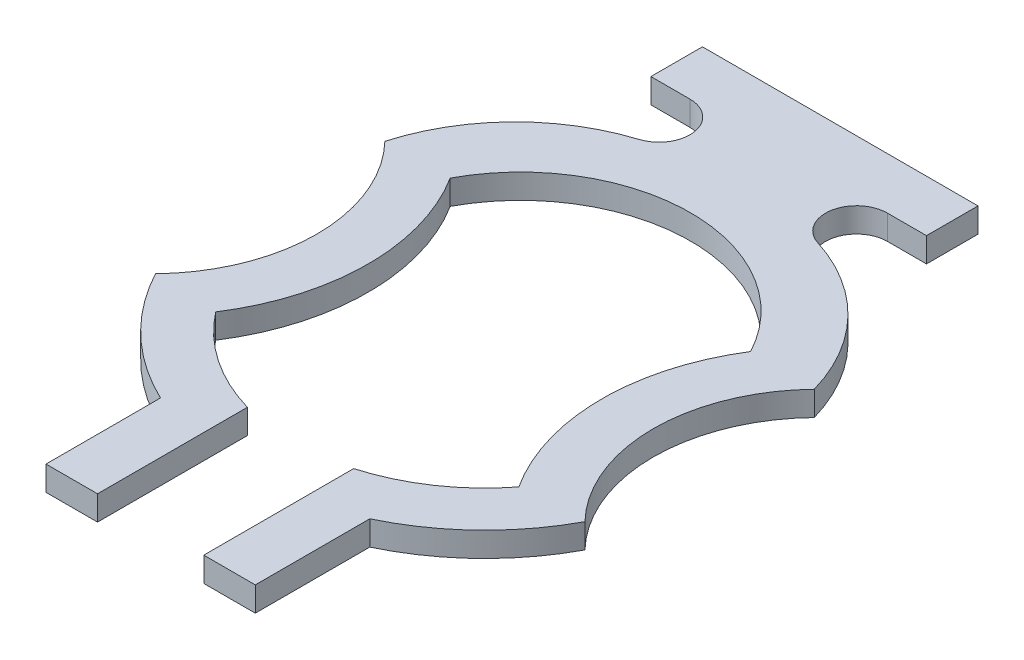
ISO-10303-21;
HEADER;
FILE_DESCRIPTION(('STEP AP214'),'2;1');
FILE_NAME('part.step','',(''),(''),'','','');
FILE_SCHEMA(('AUTOMOTIVE_DESIGN { 1 0 10303 214 1 1 1 1 }'));
ENDSEC;
DATA;
#1=APPLICATION_CONTEXT('core data for automotive mechanical design processes');
#2=APPLICATION_PROTOCOL_DEFINITION('international standard','automotive_design',2000,#1);
#3=PRODUCT_CONTEXT('',#1,'mechanical');
#4=PRODUCT('Part','Part','',(#3));
#5=PRODUCT_RELATED_PRODUCT_CATEGORY('part','',(#4));
#6=PRODUCT_DEFINITION_FORMATION('','',#4);
#7=PRODUCT_DEFINITION_CONTEXT('part definition',#1,'design');
#8=PRODUCT_DEFINITION('design','',#6,#7);
#9=PRODUCT_DEFINITION_SHAPE('','',#8);
#10=(LENGTH_UNIT() NAMED_UNIT(*) SI_UNIT(.MILLI.,.METRE.));
#11=(NAMED_UNIT(*) PLANE_ANGLE_UNIT() SI_UNIT($,.RADIAN.));
#12=(NAMED_UNIT(*) SI_UNIT($,.STERADIAN.) SOLID_ANGLE_UNIT());
#13=UNCERTAINTY_MEASURE_WITH_UNIT(LENGTH_MEASURE(1.E-05),#10,'distance_accuracy_value','');
#14=(GEOMETRIC_REPRESENTATION_CONTEXT(3) GLOBAL_UNCERTAINTY_ASSIGNED_CONTEXT((#13)) GLOBAL_UNIT_ASSIGNED_CONTEXT((#10,
#11,#12)) REPRESENTATION_CONTEXT('',''));
#15=CARTESIAN_POINT('',(0.,0.,0.));
#16=DIRECTION('',(0.,0.,1.));
#17=DIRECTION('',(1.,0.,0.));
#18=AXIS2_PLACEMENT_3D('',#15,#16,#17);
#19=CARTESIAN_POINT('',(0.,0.075,-0.1085));
#20=DIRECTION('',(0.,-1.,0.));
#21=DIRECTION('',(0.,0.,-1.));
#22=AXIS2_PLACEMENT_3D('',#19,#20,#21);
#23=CYLINDRICAL_SURFACE('',#22,0.520300000000001);
#24=CARTESIAN_POINT('',(0.,0.,-0.1085));
#25=DIRECTION('',(0.,-1.,0.));
#26=DIRECTION('',(0.,0.,1.));
#27=AXIS2_PLACEMENT_3D('',#24,#25,#26);
#28=CIRCLE('',#27,0.520300000000001);
#29=CARTESIAN_POINT('',(-0.459187912512323,0.,-0.353160072350572));
#30=VERTEX_POINT('',#29);
#31=CARTESIAN_POINT('',(0.459187912512322,0.,-0.353160072350571));
#32=VERTEX_POINT('',#31);
#33=EDGE_CURVE('E227',#30,#32,#28,.T.);
#34=ORIENTED_EDGE('',*,*,#33,.T.);
#35=DIRECTION('',(0.,-1.,0.));
#36=VECTOR('',#35,1.);
#37=CARTESIAN_POINT('',(0.459187912512322,0.075,-0.353160072350571));
#38=LINE('',#37,#36);
#39=CARTESIAN_POINT('',(0.459187912512322,0.075,-0.353160072350571));
#40=VERTEX_POINT('',#39);
#41=EDGE_CURVE('E11',#40,#32,#38,.T.);
#42=ORIENTED_EDGE('',*,*,#41,.F.);
#43=CARTESIAN_POINT('',(0.,0.075,-0.1085));
#44=DIRECTION('',(0.,-1.,0.));
#45=DIRECTION('',(0.,0.,1.));
#46=AXIS2_PLACEMENT_3D('',#43,#44,#45);
#47=CIRCLE('',#46,0.520300000000001);
#48=CARTESIAN_POINT('',(-0.459187912512323,0.075,-0.353160072350572));
#49=VERTEX_POINT('',#48);
#50=EDGE_CURVE('E273',#49,#40,#47,.T.);
#51=ORIENTED_EDGE('',*,*,#50,.F.);
#52=DIRECTION('',(0.,-1.,0.));
#53=VECTOR('',#52,1.);
#54=CARTESIAN_POINT('',(-0.459187912512323,0.075,-0.353160072350572));
#55=LINE('',#54,#53);
#56=EDGE_CURVE('E223',#49,#30,#55,.T.);
#57=ORIENTED_EDGE('',*,*,#56,.T.);
#58=EDGE_LOOP('',(#34,#42,#51,#57));
#59=FACE_BOUND('',#58,.T.);
#60=ADVANCED_FACE('F35',(#59),#23,.F.);
#61=CARTESIAN_POINT('',(1.01900000000682,0.075,0.));
#62=DIRECTION('',(0.,-1.,0.));
#63=DIRECTION('',(0.,0.,-1.));
#64=AXIS2_PLACEMENT_3D('',#61,#62,#63);
#65=CYLINDRICAL_SURFACE('',#64,0.66190000000575);
#66=CARTESIAN_POINT('',(1.01900000000682,0.,0.));
#67=DIRECTION('',(0.,1.,0.));
#68=DIRECTION('',(0.,0.,1.));
#69=AXIS2_PLACEMENT_3D('',#66,#67,#68);
#70=CIRCLE('',#69,0.66190000000575);
#71=CARTESIAN_POINT('',(0.463312875368008,0.,0.359615669177845));
#72=VERTEX_POINT('',#71);
#73=EDGE_CURVE('E230',#32,#72,#70,.T.);
#74=ORIENTED_EDGE('',*,*,#73,.T.);
#75=DIRECTION('',(0.,-1.,0.));
#76=VECTOR('',#75,1.);
#77=CARTESIAN_POINT('',(0.463312875368008,0.075,0.359615669177845));
#78=LINE('',#77,#76);
#79=CARTESIAN_POINT('',(0.463312875368008,0.075,0.359615669177845));
#80=VERTEX_POINT('',#79);
#81=EDGE_CURVE('E43',#80,#72,#78,.T.);
#82=ORIENTED_EDGE('',*,*,#81,.F.);
#83=CARTESIAN_POINT('',(1.01900000000682,0.075,0.));
#84=DIRECTION('',(0.,1.,0.));
#85=DIRECTION('',(0.,0.,1.));
#86=AXIS2_PLACEMENT_3D('',#83,#84,#85);
#87=CIRCLE('',#86,0.66190000000575);
#88=EDGE_CURVE('E142',#40,#80,#87,.T.);
#89=ORIENTED_EDGE('',*,*,#88,.F.);
#90=ORIENTED_EDGE('',*,*,#41,.T.);
#91=EDGE_LOOP('',(#74,#82,#89,#90));
#92=FACE_BOUND('',#91,.T.);
#93=ADVANCED_FACE('F411',(#92),#65,.T.);
#94=CARTESIAN_POINT('',(0.,0.075,0.));
#95=DIRECTION('',(0.,-1.,0.));
#96=DIRECTION('',(0.,0.,-1.));
#97=AXIS2_PLACEMENT_3D('',#94,#95,#96);
#98=CYLINDRICAL_SURFACE('',#97,0.5865);
#99=CARTESIAN_POINT('',(0.,0.,0.));
#100=DIRECTION('',(0.,-1.,0.));
#101=DIRECTION('',(0.,0.,1.));
#102=AXIS2_PLACEMENT_3D('',#99,#100,#101);
#103=CIRCLE('',#102,0.5865);
#104=CARTESIAN_POINT('',(0.1624,0.,0.563567644564519));
#105=VERTEX_POINT('',#104);
#106=EDGE_CURVE('E232',#72,#105,#103,.T.);
#107=ORIENTED_EDGE('',*,*,#106,.T.);
#108=DIRECTION('',(0.,-1.,0.));
#109=VECTOR('',#108,1.);
#110=CARTESIAN_POINT('',(0.1624,0.075,0.563567644564519));
#111=LINE('',#110,#109);
#112=CARTESIAN_POINT('',(0.1624,0.075,0.563567644564519));
#113=VERTEX_POINT('',#112);
#114=EDGE_CURVE('E328',#113,#105,#111,.T.);
#115=ORIENTED_EDGE('',*,*,#114,.F.);
#116=CARTESIAN_POINT('',(0.,0.075,0.));
#117=DIRECTION('',(0.,-1.,0.));
#118=DIRECTION('',(0.,0.,1.));
#119=AXIS2_PLACEMENT_3D('',#116,#117,#118);
#120=CIRCLE('',#119,0.5865);
#121=EDGE_CURVE('E336',#80,#113,#120,.T.);
#122=ORIENTED_EDGE('',*,*,#121,.F.);
#123=ORIENTED_EDGE('',*,*,#81,.T.);
#124=EDGE_LOOP('',(#107,#115,#122,#123));
#125=FACE_BOUND('',#124,.T.);
#126=ADVANCED_FACE('F334',(#125),#98,.F.);
#127=CARTESIAN_POINT('',(0.1624,0.075,0.563567644564519));
#128=DIRECTION('',(1.,0.,7.01860133029449E-12));
#129=DIRECTION('',(7.01860133029449E-12,0.,-1.));
#130=AXIS2_PLACEMENT_3D('',#127,#128,#129);
#131=PLANE('',#130);
#132=DIRECTION('',(-7.0186013302945E-12,0.,1.));
#133=VECTOR('',#132,1.);
#134=CARTESIAN_POINT('',(0.1624,0.,0.563567644564519));
#135=LINE('',#134,#133);
#136=CARTESIAN_POINT('',(0.162399999996784,0.,1.02179999999476));
#137=VERTEX_POINT('',#136);
#138=EDGE_CURVE('E234',#105,#137,#135,.T.);
#139=ORIENTED_EDGE('',*,*,#138,.T.);
#140=DIRECTION('',(0.,-1.,0.));
#141=VECTOR('',#140,1.);
#142=CARTESIAN_POINT('',(0.162399999996784,0.075,1.02179999999476));
#143=LINE('',#142,#141);
#144=CARTESIAN_POINT('',(0.162399999996784,0.075,1.02179999999476));
#145=VERTEX_POINT('',#144);
#146=EDGE_CURVE('E325',#145,#137,#143,.T.);
#147=ORIENTED_EDGE('',*,*,#146,.F.);
#148=DIRECTION('',(-7.0186013302945E-12,0.,1.));
#149=VECTOR('',#148,1.);
#150=CARTESIAN_POINT('',(0.1624,0.075,0.563567644564519));
#151=LINE('',#150,#149);
#152=EDGE_CURVE('E354',#113,#145,#151,.T.);
#153=ORIENTED_EDGE('',*,*,#152,.F.);
#154=ORIENTED_EDGE('',*,*,#114,.T.);
#155=EDGE_LOOP('',(#139,#147,#153,#154));
#156=FACE_BOUND('',#155,.T.);
#157=ADVANCED_FACE('F345',(#156),#131,.F.);
#158=CARTESIAN_POINT('',(0.162399999996784,0.075,1.02179999999476));
#159=DIRECTION('',(0.,0.,-1.));
#160=DIRECTION('',(-1.,0.,0.));
#161=AXIS2_PLACEMENT_3D('',#158,#159,#160);
#162=PLANE('',#161);
#163=DIRECTION('',(1.,0.,0.));
#164=VECTOR('',#163,1.);
#165=CARTESIAN_POINT('',(0.162399999996784,0.,1.02179999999476));
#166=LINE('',#165,#164);
#167=CARTESIAN_POINT('',(0.319899999996911,0.,1.02179999999476));
#168=VERTEX_POINT('',#167);
#169=EDGE_CURVE('E236',#137,#168,#166,.T.);
#170=ORIENTED_EDGE('',*,*,#169,.T.);
#171=DIRECTION('',(0.,-1.,0.));
#172=VECTOR('',#171,1.);
#173=CARTESIAN_POINT('',(0.319899999996911,0.075,1.02179999999476));
#174=LINE('',#173,#172);
#175=CARTESIAN_POINT('',(0.319899999996911,0.075,1.02179999999476));
#176=VERTEX_POINT('',#175);
#177=EDGE_CURVE('E322',#176,#168,#174,.T.);
#178=ORIENTED_EDGE('',*,*,#177,.F.);
#179=DIRECTION('',(1.,0.,0.));
#180=VECTOR('',#179,1.);
#181=CARTESIAN_POINT('',(0.162399999996784,0.075,1.02179999999476));
#182=LINE('',#181,#180);
#183=EDGE_CURVE('E351',#145,#176,#182,.T.);
#184=ORIENTED_EDGE('',*,*,#183,.F.);
#185=ORIENTED_EDGE('',*,*,#146,.T.);
#186=EDGE_LOOP('',(#170,#178,#184,#185));
#187=FACE_BOUND('',#186,.T.);
#188=ADVANCED_FACE('F349',(#187),#162,.F.);
#189=CARTESIAN_POINT('',(0.319899999996911,0.075,1.02179999999476));
#190=DIRECTION('',(-1.,0.,-8.8258806434341E-12));
#191=DIRECTION('',(-8.8258806434341E-12,0.,1.));
#192=AXIS2_PLACEMENT_3D('',#189,#190,#191);
#193=PLANE('',#192);
#194=DIRECTION('',(8.8258806434341E-12,0.,-1.));
#195=VECTOR('',#194,1.);
#196=CARTESIAN_POINT('',(0.319899999996911,0.,1.02179999999476));
#197=LINE('',#196,#195);
#198=CARTESIAN_POINT('',(0.3199,0.,0.671824977207606));
#199=VERTEX_POINT('',#198);
#200=EDGE_CURVE('E238',#168,#199,#197,.T.);
#201=ORIENTED_EDGE('',*,*,#200,.T.);
#202=DIRECTION('',(0.,-1.,0.));
#203=VECTOR('',#202,1.);
#204=CARTESIAN_POINT('',(0.3199,0.075,0.671824977207606));
#205=LINE('',#204,#203);
#206=CARTESIAN_POINT('',(0.3199,0.075,0.671824977207606));
#207=VERTEX_POINT('',#206);
#208=EDGE_CURVE('E319',#207,#199,#205,.T.);
#209=ORIENTED_EDGE('',*,*,#208,.F.);
#210=DIRECTION('',(8.8258806434341E-12,0.,-1.));
#211=VECTOR('',#210,1.);
#212=CARTESIAN_POINT('',(0.319899999996911,0.075,1.02179999999476));
#213=LINE('',#212,#211);
#214=EDGE_CURVE('E353',#176,#207,#213,.T.);
#215=ORIENTED_EDGE('',*,*,#214,.F.);
#216=ORIENTED_EDGE('',*,*,#177,.T.);
#217=EDGE_LOOP('',(#201,#209,#215,#216));
#218=FACE_BOUND('',#217,.T.);
#219=ADVANCED_FACE('F424',(#218),#193,.F.);
#220=CARTESIAN_POINT('',(0.,0.075,0.));
#221=DIRECTION('',(0.,-1.,0.));
#222=DIRECTION('',(0.,0.,-1.));
#223=AXIS2_PLACEMENT_3D('',#220,#221,#222);
#224=CYLINDRICAL_SURFACE('',#223,0.7441);
#225=CARTESIAN_POINT('',(0.,0.,0.));
#226=DIRECTION('',(0.,1.,0.));
#227=DIRECTION('',(0.,0.,1.));
#228=AXIS2_PLACEMENT_3D('',#225,#226,#227);
#229=CIRCLE('',#228,0.7441);
#230=CARTESIAN_POINT('',(0.656342713446317,0.,0.350569611499692));
#231=VERTEX_POINT('',#230);
#232=EDGE_CURVE('E240',#199,#231,#229,.T.);
#233=ORIENTED_EDGE('',*,*,#232,.T.);
#234=DIRECTION('',(0.,-1.,0.));
#235=VECTOR('',#234,1.);
#236=CARTESIAN_POINT('',(0.656342713446317,0.075,0.350569611499692));
#237=LINE('',#236,#235);
#238=CARTESIAN_POINT('',(0.656342713446317,0.075,0.350569611499692));
#239=VERTEX_POINT('',#238);
#240=EDGE_CURVE('E316',#239,#231,#237,.T.);
#241=ORIENTED_EDGE('',*,*,#240,.F.);
#242=CARTESIAN_POINT('',(0.,0.075,0.));
#243=DIRECTION('',(0.,1.,0.));
#244=DIRECTION('',(0.,0.,1.));
#245=AXIS2_PLACEMENT_3D('',#242,#243,#244);
#246=CIRCLE('',#245,0.7441);
#247=EDGE_CURVE('E356',#207,#239,#246,.T.);
#248=ORIENTED_EDGE('',*,*,#247,.F.);
#249=ORIENTED_EDGE('',*,*,#208,.T.);
#250=EDGE_LOOP('',(#233,#241,#248,#249));
#251=FACE_BOUND('',#250,.T.);
#252=ADVANCED_FACE('F427',(#251),#224,.T.);
#253=CARTESIAN_POINT('',(1.01900000000682,0.075,0.));
#254=DIRECTION('',(0.,-1.,0.));
#255=DIRECTION('',(0.,0.,-1.));
#256=AXIS2_PLACEMENT_3D('',#253,#254,#255);
#257=CYLINDRICAL_SURFACE('',#256,0.504400000002453);
#258=CARTESIAN_POINT('',(1.01900000000682,0.,0.));
#259=DIRECTION('',(0.,-1.,0.));
#260=DIRECTION('',(0.,0.,1.));
#261=AXIS2_PLACEMENT_3D('',#258,#259,#260);
#262=CIRCLE('',#261,0.504400000002453);
#263=CARTESIAN_POINT('',(0.656331281055102,0.,-0.350557784529729));
#264=VERTEX_POINT('',#263);
#265=EDGE_CURVE('E242',#231,#264,#262,.T.);
#266=ORIENTED_EDGE('',*,*,#265,.T.);
#267=DIRECTION('',(0.,-1.,0.));
#268=VECTOR('',#267,1.);
#269=CARTESIAN_POINT('',(0.656331281055102,0.075,-0.350557784529729));
#270=LINE('',#269,#268);
#271=CARTESIAN_POINT('',(0.656331281055102,0.075,-0.350557784529729));
#272=VERTEX_POINT('',#271);
#273=EDGE_CURVE('E313',#272,#264,#270,.T.);
#274=ORIENTED_EDGE('',*,*,#273,.F.);
#275=CARTESIAN_POINT('',(1.01900000000682,0.075,0.));
#276=DIRECTION('',(0.,-1.,0.));
#277=DIRECTION('',(0.,0.,1.));
#278=AXIS2_PLACEMENT_3D('',#275,#276,#277);
#279=CIRCLE('',#278,0.504400000002453);
#280=EDGE_CURVE('E362',#239,#272,#279,.T.);
#281=ORIENTED_EDGE('',*,*,#280,.F.);
#282=ORIENTED_EDGE('',*,*,#240,.T.);
#283=EDGE_LOOP('',(#266,#274,#281,#282));
#284=FACE_BOUND('',#283,.T.);
#285=ADVANCED_FACE('F431',(#284),#257,.F.);
#286=CARTESIAN_POINT('',(0.099500000002291,0.075,-0.191511456562074));
#287=DIRECTION('',(0.,-1.,0.));
#288=DIRECTION('',(0.,0.,-1.));
#289=AXIS2_PLACEMENT_3D('',#286,#287,#288);
#290=CYLINDRICAL_SURFACE('',#289,0.579099999999059);
#291=CARTESIAN_POINT('',(0.099500000002291,0.,-0.191511456562074));
#292=DIRECTION('',(0.,1.,0.));
#293=DIRECTION('',(0.,0.,1.));
#294=AXIS2_PLACEMENT_3D('',#291,#292,#293);
#295=CIRCLE('',#294,0.579099999999059);
#296=CARTESIAN_POINT('',(0.27344932199932,0.,-0.743868626674488));
#297=VERTEX_POINT('',#296);
#298=EDGE_CURVE('E244',#264,#297,#295,.T.);
#299=ORIENTED_EDGE('',*,*,#298,.T.);
#300=DIRECTION('',(0.,-1.,0.));
#301=VECTOR('',#300,1.);
#302=CARTESIAN_POINT('',(0.27344932199932,0.075,-0.743868626674488));
#303=LINE('',#302,#301);
#304=CARTESIAN_POINT('',(0.27344932199932,0.075,-0.743868626674488));
#305=VERTEX_POINT('',#304);
#306=EDGE_CURVE('E310',#305,#297,#303,.T.);
#307=ORIENTED_EDGE('',*,*,#306,.F.);
#308=CARTESIAN_POINT('',(0.099500000002291,0.075,-0.191511456562074));
#309=DIRECTION('',(0.,1.,0.));
#310=DIRECTION('',(0.,0.,1.));
#311=AXIS2_PLACEMENT_3D('',#308,#309,#310);
#312=CIRCLE('',#311,0.579099999999059);
#313=EDGE_CURVE('E364',#272,#305,#312,.T.);
#314=ORIENTED_EDGE('',*,*,#313,.F.);
#315=ORIENTED_EDGE('',*,*,#273,.T.);
#316=EDGE_LOOP('',(#299,#307,#314,#315));
#317=FACE_BOUND('',#316,.T.);
#318=ADVANCED_FACE('F435',(#317),#290,.T.);
#319=CARTESIAN_POINT('',(0.301865149768224,0.075,-0.8341));
#320=DIRECTION('',(0.,-1.,0.));
#321=DIRECTION('',(0.,0.,-1.));
#322=AXIS2_PLACEMENT_3D('',#319,#320,#321);
#323=CYLINDRICAL_SURFACE('',#322,0.0946000000000001);
#324=CARTESIAN_POINT('',(0.301865149768224,0.,-0.8341));
#325=DIRECTION('',(0.,-1.,0.));
#326=DIRECTION('',(0.,0.,1.));
#327=AXIS2_PLACEMENT_3D('',#324,#325,#326);
#328=CIRCLE('',#327,0.0946000000000001);
#329=CARTESIAN_POINT('',(0.301865149768224,0.,-0.9287));
#330=VERTEX_POINT('',#329);
#331=EDGE_CURVE('E246',#297,#330,#328,.T.);
#332=ORIENTED_EDGE('',*,*,#331,.T.);
#333=DIRECTION('',(0.,-1.,0.));
#334=VECTOR('',#333,1.);
#335=CARTESIAN_POINT('',(0.301865149768224,0.075,-0.9287));
#336=LINE('',#335,#334);
#337=CARTESIAN_POINT('',(0.301865149768224,0.075,-0.9287));
#338=VERTEX_POINT('',#337);
#339=EDGE_CURVE('E307',#338,#330,#336,.T.);
#340=ORIENTED_EDGE('',*,*,#339,.F.);
#341=CARTESIAN_POINT('',(0.301865149768224,0.075,-0.8341));
#342=DIRECTION('',(0.,-1.,0.));
#343=DIRECTION('',(0.,0.,1.));
#344=AXIS2_PLACEMENT_3D('',#341,#342,#343);
#345=CIRCLE('',#344,0.0946000000000001);
#346=EDGE_CURVE('E366',#305,#338,#345,.T.);
#347=ORIENTED_EDGE('',*,*,#346,.F.);
#348=ORIENTED_EDGE('',*,*,#306,.T.);
#349=EDGE_LOOP('',(#332,#340,#347,#348));
#350=FACE_BOUND('',#349,.T.);
#351=ADVANCED_FACE('F439',(#350),#323,.F.);
#352=CARTESIAN_POINT('',(0.301865149768224,0.075,-0.9287));
#353=DIRECTION('',(-1.21135339235406E-11,0.,-1.));
#354=DIRECTION('',(-1.,0.,1.21135339235406E-11));
#355=AXIS2_PLACEMENT_3D('',#352,#353,#354);
#356=PLANE('',#355);
#357=DIRECTION('',(1.,0.,-1.21135339235406E-11));
#358=VECTOR('',#357,1.);
#359=CARTESIAN_POINT('',(0.301865149768224,0.,-0.9287));
#360=LINE('',#359,#358);
#361=CARTESIAN_POINT('',(0.421200000002614,0.,-0.928700000001445));
#362=VERTEX_POINT('',#361);
#363=EDGE_CURVE('E248',#330,#362,#360,.T.);
#364=ORIENTED_EDGE('',*,*,#363,.T.);
#365=DIRECTION('',(0.,-1.,0.));
#366=VECTOR('',#365,1.);
#367=CARTESIAN_POINT('',(0.421200000002614,0.075,-0.928700000001445));
#368=LINE('',#367,#366);
#369=CARTESIAN_POINT('',(0.421200000002614,0.075,-0.928700000001445));
#370=VERTEX_POINT('',#369);
#371=EDGE_CURVE('E304',#370,#362,#368,.T.);
#372=ORIENTED_EDGE('',*,*,#371,.F.);
#373=DIRECTION('',(1.,0.,-1.21135339235406E-11));
#374=VECTOR('',#373,1.);
#375=CARTESIAN_POINT('',(0.301865149768224,0.075,-0.9287));
#376=LINE('',#375,#374);
#377=EDGE_CURVE('E368',#338,#370,#376,.T.);
#378=ORIENTED_EDGE('',*,*,#377,.F.);
#379=ORIENTED_EDGE('',*,*,#339,.T.);
#380=EDGE_LOOP('',(#364,#372,#378,#379));
#381=FACE_BOUND('',#380,.T.);
#382=ADVANCED_FACE('F443',(#381),#356,.F.);
#383=CARTESIAN_POINT('',(0.421200000002614,0.075,-1.08620000000157));
#384=DIRECTION('',(-1.,0.,0.));
#385=DIRECTION('',(0.,0.,1.));
#386=AXIS2_PLACEMENT_3D('',#383,#384,#385);
#387=PLANE('',#386);
#388=DIRECTION('',(0.,0.,-1.));
#389=VECTOR('',#388,1.);
#390=CARTESIAN_POINT('',(0.421200000002614,0.,-1.08620000000157));
#391=LINE('',#390,#389);
#392=CARTESIAN_POINT('',(0.421200000002614,0.,-1.08620000000157));
#393=VERTEX_POINT('',#392);
#394=EDGE_CURVE('E250',#362,#393,#391,.T.);
#395=ORIENTED_EDGE('',*,*,#394,.T.);
#396=DIRECTION('',(0.,-1.,0.));
#397=VECTOR('',#396,1.);
#398=CARTESIAN_POINT('',(0.421200000002614,0.075,-1.08620000000157));
#399=LINE('',#398,#397);
#400=CARTESIAN_POINT('',(0.421200000002614,0.075,-1.08620000000157));
#401=VERTEX_POINT('',#400);
#402=EDGE_CURVE('E301',#401,#393,#399,.T.);
#403=ORIENTED_EDGE('',*,*,#402,.F.);
#404=DIRECTION('',(0.,0.,-1.));
#405=VECTOR('',#404,1.);
#406=CARTESIAN_POINT('',(0.421200000002614,0.075,-1.08620000000157));
#407=LINE('',#406,#405);
#408=EDGE_CURVE('E370',#370,#401,#407,.T.);
#409=ORIENTED_EDGE('',*,*,#408,.F.);
#410=ORIENTED_EDGE('',*,*,#371,.T.);
#411=EDGE_LOOP('',(#395,#403,#409,#410));
#412=FACE_BOUND('',#411,.T.);
#413=ADVANCED_FACE('F447',(#412),#387,.F.);
#414=CARTESIAN_POINT('',(-0.421200000002622,0.075,-1.08620000000157));
#415=DIRECTION('',(0.,0.,1.));
#416=DIRECTION('',(1.,0.,0.));
#417=AXIS2_PLACEMENT_3D('',#414,#415,#416);
#418=PLANE('',#417);
#419=DIRECTION('',(-1.,0.,0.));
#420=VECTOR('',#419,1.);
#421=CARTESIAN_POINT('',(-0.421200000002622,0.,-1.08620000000157));
#422=LINE('',#421,#420);
#423=CARTESIAN_POINT('',(-0.421200000002622,0.,-1.08620000000157));
#424=VERTEX_POINT('',#423);
#425=EDGE_CURVE('E252',#393,#424,#422,.T.);
#426=ORIENTED_EDGE('',*,*,#425,.T.);
#427=DIRECTION('',(0.,-1.,0.));
#428=VECTOR('',#427,1.);
#429=CARTESIAN_POINT('',(-0.421200000002622,0.075,-1.08620000000157));
#430=LINE('',#429,#428);
#431=CARTESIAN_POINT('',(-0.421200000002622,0.075,-1.08620000000157));
#432=VERTEX_POINT('',#431);
#433=EDGE_CURVE('E298',#432,#424,#430,.T.);
#434=ORIENTED_EDGE('',*,*,#433,.F.);
#435=DIRECTION('',(-1.,0.,0.));
#436=VECTOR('',#435,1.);
#437=CARTESIAN_POINT('',(-0.421200000002622,0.075,-1.08620000000157));
#438=LINE('',#437,#436);
#439=EDGE_CURVE('E372',#401,#432,#438,.T.);
#440=ORIENTED_EDGE('',*,*,#439,.F.);
#441=ORIENTED_EDGE('',*,*,#402,.T.);
#442=EDGE_LOOP('',(#426,#434,#440,#441));
#443=FACE_BOUND('',#442,.T.);
#444=ADVANCED_FACE('F451',(#443),#418,.F.);
#445=CARTESIAN_POINT('',(-0.421200000002622,0.075,-1.08620000000157));
#446=DIRECTION('',(1.,0.,0.));
#447=DIRECTION('',(0.,0.,-1.));
#448=AXIS2_PLACEMENT_3D('',#445,#446,#447);
#449=PLANE('',#448);
#450=DIRECTION('',(0.,0.,1.));
#451=VECTOR('',#450,1.);
#452=CARTESIAN_POINT('',(-0.421200000002622,0.,-1.08620000000157));
#453=LINE('',#452,#451);
#454=CARTESIAN_POINT('',(-0.421200000002621,0.,-0.928700000001445));
#455=VERTEX_POINT('',#454);
#456=EDGE_CURVE('E254',#424,#455,#453,.T.);
#457=ORIENTED_EDGE('',*,*,#456,.T.);
#458=DIRECTION('',(0.,-1.,0.));
#459=VECTOR('',#458,1.);
#460=CARTESIAN_POINT('',(-0.421200000002621,0.075,-0.928700000001445));
#461=LINE('',#460,#459);
#462=CARTESIAN_POINT('',(-0.421200000002621,0.075,-0.928700000001445));
#463=VERTEX_POINT('',#462);
#464=EDGE_CURVE('E295',#463,#455,#461,.T.);
#465=ORIENTED_EDGE('',*,*,#464,.F.);
#466=DIRECTION('',(0.,0.,1.));
#467=VECTOR('',#466,1.);
#468=CARTESIAN_POINT('',(-0.421200000002622,0.075,-1.08620000000157));
#469=LINE('',#468,#467);
#470=EDGE_CURVE('E374',#432,#463,#469,.T.);
#471=ORIENTED_EDGE('',*,*,#470,.F.);
#472=ORIENTED_EDGE('',*,*,#433,.T.);
#473=EDGE_LOOP('',(#457,#465,#471,#472));
#474=FACE_BOUND('',#473,.T.);
#475=ADVANCED_FACE('F455',(#474),#449,.F.);
#476=CARTESIAN_POINT('',(-0.301865149768231,0.075,-0.9287));
#477=DIRECTION('',(1.21135339235406E-11,0.,-1.));
#478=DIRECTION('',(-1.,0.,-1.21135339235406E-11));
#479=AXIS2_PLACEMENT_3D('',#476,#477,#478);
#480=PLANE('',#479);
#481=DIRECTION('',(1.,0.,1.21135339235406E-11));
#482=VECTOR('',#481,1.);
#483=CARTESIAN_POINT('',(-0.301865149768231,0.,-0.9287));
#484=LINE('',#483,#482);
#485=CARTESIAN_POINT('',(-0.301865149768231,0.,-0.9287));
#486=VERTEX_POINT('',#485);
#487=EDGE_CURVE('E256',#455,#486,#484,.T.);
#488=ORIENTED_EDGE('',*,*,#487,.T.);
#489=DIRECTION('',(0.,-1.,0.));
#490=VECTOR('',#489,1.);
#491=CARTESIAN_POINT('',(-0.301865149768231,0.075,-0.9287));
#492=LINE('',#491,#490);
#493=CARTESIAN_POINT('',(-0.301865149768231,0.075,-0.9287));
#494=VERTEX_POINT('',#493);
#495=EDGE_CURVE('E292',#494,#486,#492,.T.);
#496=ORIENTED_EDGE('',*,*,#495,.F.);
#497=DIRECTION('',(1.,0.,1.21135339235406E-11));
#498=VECTOR('',#497,1.);
#499=CARTESIAN_POINT('',(-0.301865149768231,0.075,-0.9287));
#500=LINE('',#499,#498);
#501=EDGE_CURVE('E376',#463,#494,#500,.T.);
#502=ORIENTED_EDGE('',*,*,#501,.F.);
#503=ORIENTED_EDGE('',*,*,#464,.T.);
#504=EDGE_LOOP('',(#488,#496,#502,#503));
#505=FACE_BOUND('',#504,.T.);
#506=ADVANCED_FACE('F459',(#505),#480,.F.);
#507=CARTESIAN_POINT('',(-0.30186514976823,0.075,-0.8341));
#508=DIRECTION('',(0.,-1.,0.));
#509=DIRECTION('',(0.,0.,-1.));
#510=AXIS2_PLACEMENT_3D('',#507,#508,#509);
#511=CYLINDRICAL_SURFACE('',#510,0.0946000000000002);
#512=CARTESIAN_POINT('',(-0.30186514976823,0.,-0.8341));
#513=DIRECTION('',(0.,-1.,0.));
#514=DIRECTION('',(0.,0.,-1.));
#515=AXIS2_PLACEMENT_3D('',#512,#513,#514);
#516=CIRCLE('',#515,0.0946000000000002);
#517=CARTESIAN_POINT('',(-0.273449321999608,0.,-0.743868626675385));
#518=VERTEX_POINT('',#517);
#519=EDGE_CURVE('E258',#486,#518,#516,.T.);
#520=ORIENTED_EDGE('',*,*,#519,.T.);
#521=DIRECTION('',(0.,-1.,0.));
#522=VECTOR('',#521,1.);
#523=CARTESIAN_POINT('',(-0.273449321999608,0.075,-0.743868626675385));
#524=LINE('',#523,#522);
#525=CARTESIAN_POINT('',(-0.273449321999608,0.075,-0.743868626675385));
#526=VERTEX_POINT('',#525);
#527=EDGE_CURVE('E289',#526,#518,#524,.T.);
#528=ORIENTED_EDGE('',*,*,#527,.F.);
#529=CARTESIAN_POINT('',(-0.30186514976823,0.075,-0.8341));
#530=DIRECTION('',(0.,-1.,0.));
#531=DIRECTION('',(0.,0.,-1.));
#532=AXIS2_PLACEMENT_3D('',#529,#530,#531);
#533=CIRCLE('',#532,0.0946000000000002);
#534=EDGE_CURVE('E378',#494,#526,#533,.T.);
#535=ORIENTED_EDGE('',*,*,#534,.F.);
#536=ORIENTED_EDGE('',*,*,#495,.T.);
#537=EDGE_LOOP('',(#520,#528,#535,#536));
#538=FACE_BOUND('',#537,.T.);
#539=ADVANCED_FACE('F463',(#538),#511,.F.);
#540=CARTESIAN_POINT('',(-0.0995000000022924,0.075,-0.191511456562074));
#541=DIRECTION('',(0.,-1.,0.));
#542=DIRECTION('',(0.,0.,-1.));
#543=AXIS2_PLACEMENT_3D('',#540,#541,#542);
#544=CYLINDRICAL_SURFACE('',#543,0.57909999999906);
#545=CARTESIAN_POINT('',(-0.0995000000022924,0.,-0.191511456562074));
#546=DIRECTION('',(0.,1.,0.));
#547=DIRECTION('',(0.,0.,-1.));
#548=AXIS2_PLACEMENT_3D('',#545,#546,#547);
#549=CIRCLE('',#548,0.57909999999906);
#550=CARTESIAN_POINT('',(-0.656331281054245,0.,-0.350557784531694));
#551=VERTEX_POINT('',#550);
#552=EDGE_CURVE('E260',#518,#551,#549,.T.);
#553=ORIENTED_EDGE('',*,*,#552,.T.);
#554=DIRECTION('',(0.,-1.,0.));
#555=VECTOR('',#554,1.);
#556=CARTESIAN_POINT('',(-0.656331281054245,0.075,-0.350557784531694));
#557=LINE('',#556,#555);
#558=CARTESIAN_POINT('',(-0.656331281054245,0.075,-0.350557784531694));
#559=VERTEX_POINT('',#558);
#560=EDGE_CURVE('E286',#559,#551,#557,.T.);
#561=ORIENTED_EDGE('',*,*,#560,.F.);
#562=CARTESIAN_POINT('',(-0.0995000000022924,0.075,-0.191511456562074));
#563=DIRECTION('',(0.,1.,0.));
#564=DIRECTION('',(0.,0.,-1.));
#565=AXIS2_PLACEMENT_3D('',#562,#563,#564);
#566=CIRCLE('',#565,0.57909999999906);
#567=EDGE_CURVE('E380',#526,#559,#566,.T.);
#568=ORIENTED_EDGE('',*,*,#567,.F.);
#569=ORIENTED_EDGE('',*,*,#527,.T.);
#570=EDGE_LOOP('',(#553,#561,#568,#569));
#571=FACE_BOUND('',#570,.T.);
#572=ADVANCED_FACE('F467',(#571),#544,.T.);
#573=CARTESIAN_POINT('',(-1.01900000000682,0.075,0.));
#574=DIRECTION('',(0.,-1.,0.));
#575=DIRECTION('',(0.,0.,-1.));
#576=AXIS2_PLACEMENT_3D('',#573,#574,#575);
#577=CYLINDRICAL_SURFACE('',#576,0.504400000002453);
#578=CARTESIAN_POINT('',(-1.01900000000682,0.,0.));
#579=DIRECTION('',(0.,-1.,0.));
#580=DIRECTION('',(0.,0.,-1.));
#581=AXIS2_PLACEMENT_3D('',#578,#579,#580);
#582=CIRCLE('',#581,0.504400000002453);
#583=CARTESIAN_POINT('',(-0.656342713444551,0.,0.350569611501397));
#584=VERTEX_POINT('',#583);
#585=EDGE_CURVE('E262',#551,#584,#582,.T.);
#586=ORIENTED_EDGE('',*,*,#585,.T.);
#587=DIRECTION('',(0.,-1.,0.));
#588=VECTOR('',#587,1.);
#589=CARTESIAN_POINT('',(-0.656342713444551,0.075,0.350569611501397));
#590=LINE('',#589,#588);
#591=CARTESIAN_POINT('',(-0.656342713444551,0.075,0.350569611501397));
#592=VERTEX_POINT('',#591);
#593=EDGE_CURVE('E283',#592,#584,#590,.T.);
#594=ORIENTED_EDGE('',*,*,#593,.F.);
#595=CARTESIAN_POINT('',(-1.01900000000682,0.075,0.));
#596=DIRECTION('',(0.,-1.,0.));
#597=DIRECTION('',(0.,0.,-1.));
#598=AXIS2_PLACEMENT_3D('',#595,#596,#597);
#599=CIRCLE('',#598,0.504400000002453);
#600=EDGE_CURVE('E382',#559,#592,#599,.T.);
#601=ORIENTED_EDGE('',*,*,#600,.F.);
#602=ORIENTED_EDGE('',*,*,#560,.T.);
#603=EDGE_LOOP('',(#586,#594,#601,#602));
#604=FACE_BOUND('',#603,.T.);
#605=ADVANCED_FACE('F471',(#604),#577,.F.);
#606=CARTESIAN_POINT('',(0.,0.075,0.));
#607=DIRECTION('',(0.,-1.,0.));
#608=DIRECTION('',(0.,0.,-1.));
#609=AXIS2_PLACEMENT_3D('',#606,#607,#608);
#610=CYLINDRICAL_SURFACE('',#609,0.744099999999998);
#611=CARTESIAN_POINT('',(0.,0.,0.));
#612=DIRECTION('',(0.,1.,0.));
#613=DIRECTION('',(0.,0.,-1.));
#614=AXIS2_PLACEMENT_3D('',#611,#612,#613);
#615=CIRCLE('',#614,0.744099999999998);
#616=CARTESIAN_POINT('',(-0.319899999999995,0.,0.671824977207606));
#617=VERTEX_POINT('',#616);
#618=EDGE_CURVE('E264',#584,#617,#615,.T.);
#619=ORIENTED_EDGE('',*,*,#618,.T.);
#620=DIRECTION('',(0.,-1.,0.));
#621=VECTOR('',#620,1.);
#622=CARTESIAN_POINT('',(-0.319899999999995,0.075,0.671824977207606));
#623=LINE('',#622,#621);
#624=CARTESIAN_POINT('',(-0.319899999999995,0.075,0.671824977207606));
#625=VERTEX_POINT('',#624);
#626=EDGE_CURVE('E280',#625,#617,#623,.T.);
#627=ORIENTED_EDGE('',*,*,#626,.F.);
#628=CARTESIAN_POINT('',(0.,0.075,0.));
#629=DIRECTION('',(0.,1.,0.));
#630=DIRECTION('',(0.,0.,-1.));
#631=AXIS2_PLACEMENT_3D('',#628,#629,#630);
#632=CIRCLE('',#631,0.744099999999998);
#633=EDGE_CURVE('E384',#592,#625,#632,.T.);
#634=ORIENTED_EDGE('',*,*,#633,.F.);
#635=ORIENTED_EDGE('',*,*,#593,.T.);
#636=EDGE_LOOP('',(#619,#627,#634,#635));
#637=FACE_BOUND('',#636,.T.);
#638=ADVANCED_FACE('F475',(#637),#610,.T.);
#639=CARTESIAN_POINT('',(-0.319899999996904,0.075,1.02179999999476));
#640=DIRECTION('',(1.,0.,-8.83269611489396E-12));
#641=DIRECTION('',(-8.83269611489396E-12,0.,-1.));
#642=AXIS2_PLACEMENT_3D('',#639,#640,#641);
#643=PLANE('',#642);
#644=DIRECTION('',(8.83269611489396E-12,0.,1.));
#645=VECTOR('',#644,1.);
#646=CARTESIAN_POINT('',(-0.319899999996904,0.,1.02179999999476));
#647=LINE('',#646,#645);
#648=CARTESIAN_POINT('',(-0.319899999996904,0.,1.02179999999476));
#649=VERTEX_POINT('',#648);
#650=EDGE_CURVE('E266',#617,#649,#647,.T.);
#651=ORIENTED_EDGE('',*,*,#650,.T.);
#652=DIRECTION('',(0.,-1.,0.));
#653=VECTOR('',#652,1.);
#654=CARTESIAN_POINT('',(-0.319899999996904,0.075,1.02179999999476));
#655=LINE('',#654,#653);
#656=CARTESIAN_POINT('',(-0.319899999996904,0.075,1.02179999999476));
#657=VERTEX_POINT('',#656);
#658=EDGE_CURVE('E277',#657,#649,#655,.T.);
#659=ORIENTED_EDGE('',*,*,#658,.F.);
#660=DIRECTION('',(8.83269611489396E-12,0.,1.));
#661=VECTOR('',#660,1.);
#662=CARTESIAN_POINT('',(-0.319899999996904,0.075,1.02179999999476));
#663=LINE('',#662,#661);
#664=EDGE_CURVE('E386',#625,#657,#663,.T.);
#665=ORIENTED_EDGE('',*,*,#664,.F.);
#666=ORIENTED_EDGE('',*,*,#626,.T.);
#667=EDGE_LOOP('',(#651,#659,#665,#666));
#668=FACE_BOUND('',#667,.T.);
#669=ADVANCED_FACE('F392',(#668),#643,.F.);
#670=CARTESIAN_POINT('',(-0.162399999996777,0.075,1.02179999999476));
#671=DIRECTION('',(0.,0.,-1.));
#672=DIRECTION('',(-1.,0.,0.));
#673=AXIS2_PLACEMENT_3D('',#670,#671,#672);
#674=PLANE('',#673);
#675=DIRECTION('',(1.,0.,0.));
#676=VECTOR('',#675,1.);
#677=CARTESIAN_POINT('',(-0.162399999996777,0.,1.02179999999476));
#678=LINE('',#677,#676);
#679=CARTESIAN_POINT('',(-0.162399999996777,0.,1.02179999999476));
#680=VERTEX_POINT('',#679);
#681=EDGE_CURVE('E268',#649,#680,#678,.T.);
#682=ORIENTED_EDGE('',*,*,#681,.T.);
#683=DIRECTION('',(0.,-1.,0.));
#684=VECTOR('',#683,1.);
#685=CARTESIAN_POINT('',(-0.162399999996777,0.075,1.02179999999476));
#686=LINE('',#685,#684);
#687=CARTESIAN_POINT('',(-0.162399999996777,0.075,1.02179999999476));
#688=VERTEX_POINT('',#687);
#689=EDGE_CURVE('E218',#688,#680,#686,.T.);
#690=ORIENTED_EDGE('',*,*,#689,.F.);
#691=DIRECTION('',(1.,0.,0.));
#692=VECTOR('',#691,1.);
#693=CARTESIAN_POINT('',(-0.162399999996777,0.075,1.02179999999476));
#694=LINE('',#693,#692);
#695=EDGE_CURVE('E209',#657,#688,#694,.T.);
#696=ORIENTED_EDGE('',*,*,#695,.F.);
#697=ORIENTED_EDGE('',*,*,#658,.T.);
#698=EDGE_LOOP('',(#682,#690,#696,#697));
#699=FACE_BOUND('',#698,.T.);
#700=ADVANCED_FACE('F396',(#699),#674,.F.);
#701=CARTESIAN_POINT('',(-0.162399999999996,0.075,0.563567644564519));
#702=DIRECTION('',(-1.,0.,7.02558118750215E-12));
#703=DIRECTION('',(7.02558118750215E-12,0.,1.));
#704=AXIS2_PLACEMENT_3D('',#701,#702,#703);
#705=PLANE('',#704);
#706=DIRECTION('',(-7.02558118750215E-12,0.,-1.));
#707=VECTOR('',#706,1.);
#708=CARTESIAN_POINT('',(-0.162399999999996,0.,0.563567644564519));
#709=LINE('',#708,#707);
#710=CARTESIAN_POINT('',(-0.162399999999996,0.,0.563567644564519));
#711=VERTEX_POINT('',#710);
#712=EDGE_CURVE('E217',#680,#711,#709,.T.);
#713=ORIENTED_EDGE('',*,*,#712,.T.);
#714=DIRECTION('',(0.,-1.,0.));
#715=VECTOR('',#714,1.);
#716=CARTESIAN_POINT('',(-0.162399999999996,0.075,0.563567644564519));
#717=LINE('',#716,#715);
#718=CARTESIAN_POINT('',(-0.162399999999996,0.075,0.563567644564519));
#719=VERTEX_POINT('',#718);
#720=EDGE_CURVE('E214',#719,#711,#717,.T.);
#721=ORIENTED_EDGE('',*,*,#720,.F.);
#722=DIRECTION('',(-7.02558118750215E-12,0.,-1.));
#723=VECTOR('',#722,1.);
#724=CARTESIAN_POINT('',(-0.162399999999996,0.075,0.563567644564519));
#725=LINE('',#724,#723);
#726=EDGE_CURVE('E203',#688,#719,#725,.T.);
#727=ORIENTED_EDGE('',*,*,#726,.F.);
#728=ORIENTED_EDGE('',*,*,#689,.T.);
#729=EDGE_LOOP('',(#713,#721,#727,#728));
#730=FACE_BOUND('',#729,.T.);
#731=ADVANCED_FACE('F215',(#730),#705,.F.);
#732=CARTESIAN_POINT('',(0.,0.075,0.));
#733=DIRECTION('',(0.,-1.,0.));
#734=DIRECTION('',(0.,0.,-1.));
#735=AXIS2_PLACEMENT_3D('',#732,#733,#734);
#736=CYLINDRICAL_SURFACE('',#735,0.586499999999998);
#737=CARTESIAN_POINT('',(0.,0.,0.));
#738=DIRECTION('',(0.,-1.,0.));
#739=DIRECTION('',(0.,0.,-1.));
#740=AXIS2_PLACEMENT_3D('',#737,#738,#739);
#741=CIRCLE('',#740,0.586499999999998);
#742=CARTESIAN_POINT('',(-0.463312875367989,0.,0.359615669177855));
#743=VERTEX_POINT('',#742);
#744=EDGE_CURVE('E128',#711,#743,#741,.T.);
#745=ORIENTED_EDGE('',*,*,#744,.T.);
#746=DIRECTION('',(0.,-1.,0.));
#747=VECTOR('',#746,1.);
#748=CARTESIAN_POINT('',(-0.463312875367989,0.075,0.359615669177855));
#749=LINE('',#748,#747);
#750=CARTESIAN_POINT('',(-0.463312875367989,0.075,0.359615669177855));
#751=VERTEX_POINT('',#750);
#752=EDGE_CURVE('E219',#751,#743,#749,.T.);
#753=ORIENTED_EDGE('',*,*,#752,.F.);
#754=CARTESIAN_POINT('',(0.,0.075,0.));
#755=DIRECTION('',(0.,-1.,0.));
#756=DIRECTION('',(0.,0.,-1.));
#757=AXIS2_PLACEMENT_3D('',#754,#755,#756);
#758=CIRCLE('',#757,0.586499999999998);
#759=EDGE_CURVE('E207',#719,#751,#758,.T.);
#760=ORIENTED_EDGE('',*,*,#759,.F.);
#761=ORIENTED_EDGE('',*,*,#720,.T.);
#762=EDGE_LOOP('',(#745,#753,#760,#761));
#763=FACE_BOUND('',#762,.T.);
#764=ADVANCED_FACE('F221',(#763),#736,.F.);
#765=CARTESIAN_POINT('',(-1.01900000000682,0.075,0.));
#766=DIRECTION('',(0.,-1.,0.));
#767=DIRECTION('',(0.,0.,-1.));
#768=AXIS2_PLACEMENT_3D('',#765,#766,#767);
#769=CYLINDRICAL_SURFACE('',#768,0.66190000000575);
#770=CARTESIAN_POINT('',(-1.01900000000682,0.,0.));
#771=DIRECTION('',(0.,1.,0.));
#772=DIRECTION('',(0.,0.,-1.));
#773=AXIS2_PLACEMENT_3D('',#770,#771,#772);
#774=CIRCLE('',#773,0.66190000000575);
#775=EDGE_CURVE('E134',#743,#30,#774,.T.);
#776=ORIENTED_EDGE('',*,*,#775,.T.);
#777=ORIENTED_EDGE('',*,*,#56,.F.);
#778=CARTESIAN_POINT('',(-1.01900000000682,0.075,0.));
#779=DIRECTION('',(0.,1.,0.));
#780=DIRECTION('',(0.,0.,-1.));
#781=AXIS2_PLACEMENT_3D('',#778,#779,#780);
#782=CIRCLE('',#781,0.66190000000575);
#783=EDGE_CURVE('E51',#751,#49,#782,.T.);
#784=ORIENTED_EDGE('',*,*,#783,.F.);
#785=ORIENTED_EDGE('',*,*,#752,.T.);
#786=EDGE_LOOP('',(#776,#777,#784,#785));
#787=FACE_BOUND('',#786,.T.);
#788=ADVANCED_FACE('F400',(#787),#769,.T.);
#789=CARTESIAN_POINT('',(0.,0.075,-0.1085));
#790=DIRECTION('',(0.,1.,0.));
#791=DIRECTION('',(0.,0.,1.));
#792=AXIS2_PLACEMENT_3D('',#789,#790,#791);
#793=PLANE('',#792);
#794=ORIENTED_EDGE('',*,*,#50,.T.);
#795=ORIENTED_EDGE('',*,*,#88,.T.);
#796=ORIENTED_EDGE('',*,*,#121,.T.);
#797=ORIENTED_EDGE('',*,*,#152,.T.);
#798=ORIENTED_EDGE('',*,*,#183,.T.);
#799=ORIENTED_EDGE('',*,*,#214,.T.);
#800=ORIENTED_EDGE('',*,*,#247,.T.);
#801=ORIENTED_EDGE('',*,*,#280,.T.);
#802=ORIENTED_EDGE('',*,*,#313,.T.);
#803=ORIENTED_EDGE('',*,*,#346,.T.);
#804=ORIENTED_EDGE('',*,*,#377,.T.);
#805=ORIENTED_EDGE('',*,*,#408,.T.);
#806=ORIENTED_EDGE('',*,*,#439,.T.);
#807=ORIENTED_EDGE('',*,*,#470,.T.);
#808=ORIENTED_EDGE('',*,*,#501,.T.);
#809=ORIENTED_EDGE('',*,*,#534,.T.);
#810=ORIENTED_EDGE('',*,*,#567,.T.);
#811=ORIENTED_EDGE('',*,*,#600,.T.);
#812=ORIENTED_EDGE('',*,*,#633,.T.);
#813=ORIENTED_EDGE('',*,*,#664,.T.);
#814=ORIENTED_EDGE('',*,*,#695,.T.);
#815=ORIENTED_EDGE('',*,*,#726,.T.);
#816=ORIENTED_EDGE('',*,*,#759,.T.);
#817=ORIENTED_EDGE('',*,*,#783,.T.);
#818=EDGE_LOOP('',(#794,#795,#796,#797,#798,#799,#800,#801,#802,#803,#804,#805,#806,#807,#808,
#809,#810,#811,#812,#813,#814,#815,#816,#817));
#819=FACE_BOUND('',#818,.T.);
#820=ADVANCED_FACE('F205',(#819),#793,.T.);
#821=CARTESIAN_POINT('',(0.,0.,-0.1085));
#822=DIRECTION('',(0.,1.,0.));
#823=DIRECTION('',(0.,0.,1.));
#824=AXIS2_PLACEMENT_3D('',#821,#822,#823);
#825=PLANE('',#824);
#826=ORIENTED_EDGE('',*,*,#33,.F.);
#827=ORIENTED_EDGE('',*,*,#775,.F.);
#828=ORIENTED_EDGE('',*,*,#744,.F.);
#829=ORIENTED_EDGE('',*,*,#712,.F.);
#830=ORIENTED_EDGE('',*,*,#681,.F.);
#831=ORIENTED_EDGE('',*,*,#650,.F.);
#832=ORIENTED_EDGE('',*,*,#618,.F.);
#833=ORIENTED_EDGE('',*,*,#585,.F.);
#834=ORIENTED_EDGE('',*,*,#552,.F.);
#835=ORIENTED_EDGE('',*,*,#519,.F.);
#836=ORIENTED_EDGE('',*,*,#487,.F.);
#837=ORIENTED_EDGE('',*,*,#456,.F.);
#838=ORIENTED_EDGE('',*,*,#425,.F.);
#839=ORIENTED_EDGE('',*,*,#394,.F.);
#840=ORIENTED_EDGE('',*,*,#363,.F.);
#841=ORIENTED_EDGE('',*,*,#331,.F.);
#842=ORIENTED_EDGE('',*,*,#298,.F.);
#843=ORIENTED_EDGE('',*,*,#265,.F.);
#844=ORIENTED_EDGE('',*,*,#232,.F.);
#845=ORIENTED_EDGE('',*,*,#200,.F.);
#846=ORIENTED_EDGE('',*,*,#169,.F.);
#847=ORIENTED_EDGE('',*,*,#138,.F.);
#848=ORIENTED_EDGE('',*,*,#106,.F.);
#849=ORIENTED_EDGE('',*,*,#73,.F.);
#850=EDGE_LOOP('',(#826,#827,#828,#829,#830,#831,#832,#833,#834,#835,#836,#837,#838,#839,#840,
#841,#842,#843,#844,#845,#846,#847,#848,#849));
#851=FACE_BOUND('',#850,.T.);
#852=ADVANCED_FACE('F340',(#851),#825,.F.);
#853=CLOSED_SHELL('',(#60,#93,#126,#157,#188,#219,#252,#285,#318,#351,#382,#413,#444,#475,#506,
#539,#572,#605,#638,#669,#700,#731,#764,#788,#820,#852));
#854=MANIFOLD_SOLID_BREP('B2',#853);
#855=ADVANCED_BREP_SHAPE_REPRESENTATION('',(#18,#854),#14);
#856=SHAPE_DEFINITION_REPRESENTATION(#9,#855);
ENDSEC;
END-ISO-10303-21;
